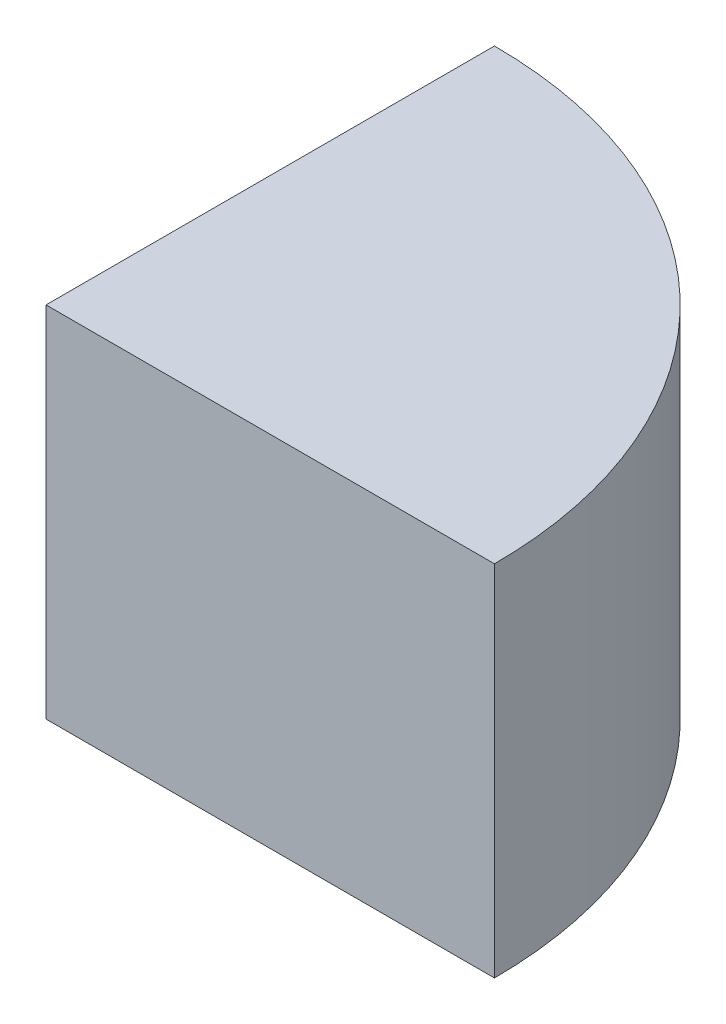
ISO-10303-21;
HEADER;
FILE_DESCRIPTION(('STEP AP214'),'2;1');
FILE_NAME('part.step','',(''),(''),'','','');
FILE_SCHEMA(('AUTOMOTIVE_DESIGN { 1 0 10303 214 1 1 1 1 }'));
ENDSEC;
DATA;
#1=APPLICATION_CONTEXT('core data for automotive mechanical design processes');
#2=APPLICATION_PROTOCOL_DEFINITION('international standard','automotive_design',2000,#1);
#3=PRODUCT_CONTEXT('',#1,'mechanical');
#4=PRODUCT('Part','Part','',(#3));
#5=PRODUCT_RELATED_PRODUCT_CATEGORY('part','',(#4));
#6=PRODUCT_DEFINITION_FORMATION('','',#4);
#7=PRODUCT_DEFINITION_CONTEXT('part definition',#1,'design');
#8=PRODUCT_DEFINITION('design','',#6,#7);
#9=PRODUCT_DEFINITION_SHAPE('','',#8);
#10=(LENGTH_UNIT() NAMED_UNIT(*) SI_UNIT(.MILLI.,.METRE.));
#11=(NAMED_UNIT(*) PLANE_ANGLE_UNIT() SI_UNIT($,.RADIAN.));
#12=(NAMED_UNIT(*) SI_UNIT($,.STERADIAN.) SOLID_ANGLE_UNIT());
#13=UNCERTAINTY_MEASURE_WITH_UNIT(LENGTH_MEASURE(1.E-05),#10,'distance_accuracy_value','');
#14=(GEOMETRIC_REPRESENTATION_CONTEXT(3) GLOBAL_UNCERTAINTY_ASSIGNED_CONTEXT((#13)) GLOBAL_UNIT_ASSIGNED_CONTEXT((#10,
#11,#12)) REPRESENTATION_CONTEXT('',''));
#15=CARTESIAN_POINT('',(0.,0.,0.));
#16=DIRECTION('',(0.,0.,1.));
#17=DIRECTION('',(1.,0.,0.));
#18=AXIS2_PLACEMENT_3D('',#15,#16,#17);
#19=CARTESIAN_POINT('',(0.,28.,0.));
#20=DIRECTION('',(0.,0.,-1.));
#21=DIRECTION('',(-1.,0.,0.));
#22=AXIS2_PLACEMENT_3D('',#19,#20,#21);
#23=PLANE('',#22);
#24=DIRECTION('',(1.,0.,0.));
#25=VECTOR('',#24,1.);
#26=CARTESIAN_POINT('',(0.,0.,0.));
#27=LINE('',#26,#25);
#28=CARTESIAN_POINT('',(0.,0.,0.));
#29=VERTEX_POINT('',#28);
#30=CARTESIAN_POINT('',(35.,0.,0.));
#31=VERTEX_POINT('',#30);
#32=EDGE_CURVE('E85',#29,#31,#27,.T.);
#33=ORIENTED_EDGE('',*,*,#32,.T.);
#34=DIRECTION('',(0.,-1.,0.));
#35=VECTOR('',#34,1.);
#36=CARTESIAN_POINT('',(35.,28.,0.));
#37=LINE('',#36,#35);
#38=CARTESIAN_POINT('',(35.,28.,0.));
#39=VERTEX_POINT('',#38);
#40=EDGE_CURVE('E11',#39,#31,#37,.T.);
#41=ORIENTED_EDGE('',*,*,#40,.F.);
#42=DIRECTION('',(1.,0.,0.));
#43=VECTOR('',#42,1.);
#44=CARTESIAN_POINT('',(0.,28.,0.));
#45=LINE('',#44,#43);
#46=CARTESIAN_POINT('',(0.,28.,0.));
#47=VERTEX_POINT('',#46);
#48=EDGE_CURVE('E80',#47,#39,#45,.T.);
#49=ORIENTED_EDGE('',*,*,#48,.F.);
#50=DIRECTION('',(0.,-1.,0.));
#51=VECTOR('',#50,1.);
#52=CARTESIAN_POINT('',(0.,28.,0.));
#53=LINE('',#52,#51);
#54=EDGE_CURVE('E55',#47,#29,#53,.T.);
#55=ORIENTED_EDGE('',*,*,#54,.T.);
#56=EDGE_LOOP('',(#33,#41,#49,#55));
#57=FACE_BOUND('',#56,.T.);
#58=ADVANCED_FACE('F39',(#57),#23,.F.);
#59=CARTESIAN_POINT('',(0.,28.,0.));
#60=DIRECTION('',(0.,-1.,0.));
#61=DIRECTION('',(0.,0.,-1.));
#62=AXIS2_PLACEMENT_3D('',#59,#60,#61);
#63=CYLINDRICAL_SURFACE('',#62,35.);
#64=CARTESIAN_POINT('',(0.,0.,0.));
#65=DIRECTION('',(0.,1.,0.));
#66=DIRECTION('',(0.,0.,1.));
#67=AXIS2_PLACEMENT_3D('',#64,#65,#66);
#68=CIRCLE('',#67,35.);
#69=CARTESIAN_POINT('',(0.,0.,-35.));
#70=VERTEX_POINT('',#69);
#71=EDGE_CURVE('E88',#31,#70,#68,.T.);
#72=ORIENTED_EDGE('',*,*,#71,.T.);
#73=DIRECTION('',(0.,-1.,0.));
#74=VECTOR('',#73,1.);
#75=CARTESIAN_POINT('',(0.,28.,-35.));
#76=LINE('',#75,#74);
#77=CARTESIAN_POINT('',(0.,28.,-35.));
#78=VERTEX_POINT('',#77);
#79=EDGE_CURVE('E47',#78,#70,#76,.T.);
#80=ORIENTED_EDGE('',*,*,#79,.F.);
#81=CARTESIAN_POINT('',(0.,28.,0.));
#82=DIRECTION('',(0.,1.,0.));
#83=DIRECTION('',(0.,0.,1.));
#84=AXIS2_PLACEMENT_3D('',#81,#82,#83);
#85=CIRCLE('',#84,35.);
#86=EDGE_CURVE('E73',#39,#78,#85,.T.);
#87=ORIENTED_EDGE('',*,*,#86,.F.);
#88=ORIENTED_EDGE('',*,*,#40,.T.);
#89=EDGE_LOOP('',(#72,#80,#87,#88));
#90=FACE_BOUND('',#89,.T.);
#91=ADVANCED_FACE('F75',(#90),#63,.T.);
#92=CARTESIAN_POINT('',(0.,28.,0.));
#93=DIRECTION('',(-1.,0.,0.));
#94=DIRECTION('',(0.,0.,1.));
#95=AXIS2_PLACEMENT_3D('',#92,#93,#94);
#96=PLANE('',#95);
#97=DIRECTION('',(0.,0.,-1.));
#98=VECTOR('',#97,1.);
#99=CARTESIAN_POINT('',(0.,0.,0.));
#100=LINE('',#99,#98);
#101=EDGE_CURVE('E83',#29,#70,#100,.T.);
#102=ORIENTED_EDGE('',*,*,#101,.F.);
#103=ORIENTED_EDGE('',*,*,#54,.F.);
#104=DIRECTION('',(0.,0.,-1.));
#105=VECTOR('',#104,1.);
#106=CARTESIAN_POINT('',(0.,28.,0.));
#107=LINE('',#106,#105);
#108=EDGE_CURVE('E79',#47,#78,#107,.T.);
#109=ORIENTED_EDGE('',*,*,#108,.T.);
#110=ORIENTED_EDGE('',*,*,#79,.T.);
#111=EDGE_LOOP('',(#102,#103,#109,#110));
#112=FACE_BOUND('',#111,.T.);
#113=ADVANCED_FACE('F94',(#112),#96,.T.);
#114=CARTESIAN_POINT('',(0.,28.,0.));
#115=DIRECTION('',(0.,1.,0.));
#116=DIRECTION('',(0.,0.,1.));
#117=AXIS2_PLACEMENT_3D('',#114,#115,#116);
#118=PLANE('',#117);
#119=ORIENTED_EDGE('',*,*,#48,.T.);
#120=ORIENTED_EDGE('',*,*,#86,.T.);
#121=ORIENTED_EDGE('',*,*,#108,.F.);
#122=EDGE_LOOP('',(#119,#120,#121));
#123=FACE_BOUND('',#122,.T.);
#124=ADVANCED_FACE('F82',(#123),#118,.T.);
#125=CARTESIAN_POINT('',(0.,0.,0.));
#126=DIRECTION('',(0.,1.,0.));
#127=DIRECTION('',(0.,0.,1.));
#128=AXIS2_PLACEMENT_3D('',#125,#126,#127);
#129=PLANE('',#128);
#130=ORIENTED_EDGE('',*,*,#32,.F.);
#131=ORIENTED_EDGE('',*,*,#101,.T.);
#132=ORIENTED_EDGE('',*,*,#71,.F.);
#133=EDGE_LOOP('',(#130,#131,#132));
#134=FACE_BOUND('',#133,.T.);
#135=ADVANCED_FACE('F101',(#134),#129,.F.);
#136=CLOSED_SHELL('',(#58,#91,#113,#124,#135));
#137=MANIFOLD_SOLID_BREP('B2',#136);
#138=ADVANCED_BREP_SHAPE_REPRESENTATION('',(#18,#137),#14);
#139=SHAPE_DEFINITION_REPRESENTATION(#9,#138);
ENDSEC;
END-ISO-10303-21;
